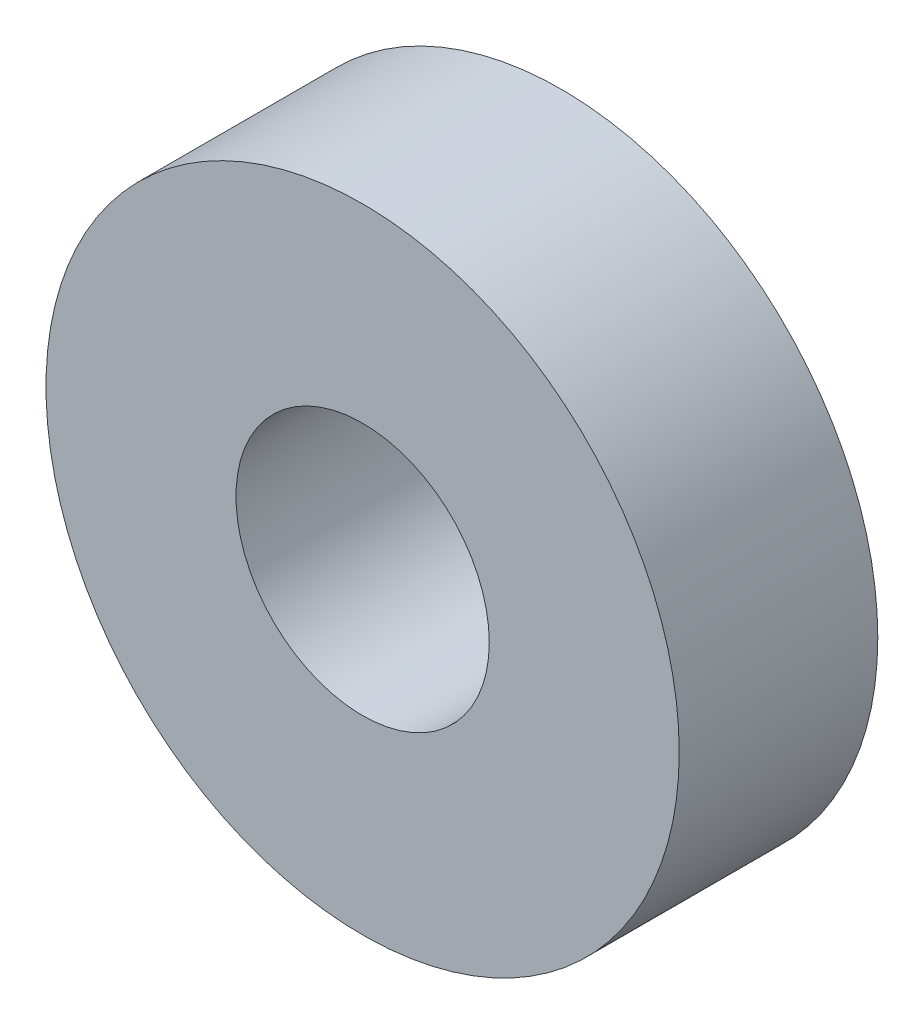
ISO-10303-21;
HEADER;
FILE_DESCRIPTION(('STEP AP214'),'2;1');
FILE_NAME('part.step','',(''),(''),'','','');
FILE_SCHEMA(('AUTOMOTIVE_DESIGN { 1 0 10303 214 1 1 1 1 }'));
ENDSEC;
DATA;
#1=APPLICATION_CONTEXT('core data for automotive mechanical design processes');
#2=APPLICATION_PROTOCOL_DEFINITION('international standard','automotive_design',2000,#1);
#3=PRODUCT_CONTEXT('',#1,'mechanical');
#4=PRODUCT('Part','Part','',(#3));
#5=PRODUCT_RELATED_PRODUCT_CATEGORY('part','',(#4));
#6=PRODUCT_DEFINITION_FORMATION('','',#4);
#7=PRODUCT_DEFINITION_CONTEXT('part definition',#1,'design');
#8=PRODUCT_DEFINITION('design','',#6,#7);
#9=PRODUCT_DEFINITION_SHAPE('','',#8);
#10=(LENGTH_UNIT() NAMED_UNIT(*) SI_UNIT(.MILLI.,.METRE.));
#11=(NAMED_UNIT(*) PLANE_ANGLE_UNIT() SI_UNIT($,.RADIAN.));
#12=(NAMED_UNIT(*) SI_UNIT($,.STERADIAN.) SOLID_ANGLE_UNIT());
#13=UNCERTAINTY_MEASURE_WITH_UNIT(LENGTH_MEASURE(1.E-05),#10,'distance_accuracy_value','');
#14=(GEOMETRIC_REPRESENTATION_CONTEXT(3) GLOBAL_UNCERTAINTY_ASSIGNED_CONTEXT((#13)) GLOBAL_UNIT_ASSIGNED_CONTEXT((#10,
#11,#12)) REPRESENTATION_CONTEXT('',''));
#15=CARTESIAN_POINT('',(0.,0.,0.));
#16=DIRECTION('',(0.,0.,1.));
#17=DIRECTION('',(1.,0.,0.));
#18=AXIS2_PLACEMENT_3D('',#15,#16,#17);
#19=CARTESIAN_POINT('',(0.,7.9375,-2.4892));
#20=DIRECTION('',(0.,0.,1.));
#21=DIRECTION('',(1.,0.,0.));
#22=AXIS2_PLACEMENT_3D('',#19,#20,#21);
#23=PLANE('',#22);
#24=CARTESIAN_POINT('',(0.,0.,-2.4892));
#25=DIRECTION('',(0.,0.,1.));
#26=DIRECTION('',(1.,0.,0.));
#27=AXIS2_PLACEMENT_3D('',#24,#25,#26);
#28=CIRCLE('',#27,3.175);
#29=CARTESIAN_POINT('',(3.175,0.,-2.4892));
#30=VERTEX_POINT('',#29);
#31=EDGE_CURVE('E18',#30,#30,#28,.T.);
#32=ORIENTED_EDGE('',*,*,#31,.T.);
#33=EDGE_LOOP('',(#32));
#34=FACE_BOUND('',#33,.T.);
#35=CARTESIAN_POINT('',(0.,0.,-2.4892));
#36=DIRECTION('',(0.,0.,1.));
#37=DIRECTION('',(1.,0.,0.));
#38=AXIS2_PLACEMENT_3D('',#35,#36,#37);
#39=CIRCLE('',#38,7.9375);
#40=CARTESIAN_POINT('',(7.9375,0.,-2.4892));
#41=VERTEX_POINT('',#40);
#42=EDGE_CURVE('E27',#41,#41,#39,.T.);
#43=ORIENTED_EDGE('',*,*,#42,.F.);
#44=EDGE_LOOP('',(#43));
#45=FACE_BOUND('',#44,.T.);
#46=ADVANCED_FACE('F15',(#34,#45),#23,.F.);
#47=CARTESIAN_POINT('',(0.,0.,26.5033284993587));
#48=DIRECTION('',(0.,0.,1.));
#49=DIRECTION('',(1.,0.,0.));
#50=AXIS2_PLACEMENT_3D('',#47,#48,#49);
#51=CYLINDRICAL_SURFACE('',#50,3.175);
#52=ORIENTED_EDGE('',*,*,#31,.F.);
#53=EDGE_LOOP('',(#52));
#54=FACE_BOUND('',#53,.T.);
#55=CARTESIAN_POINT('',(0.,0.,2.4892));
#56=DIRECTION('',(0.,0.,1.));
#57=DIRECTION('',(1.,0.,0.));
#58=AXIS2_PLACEMENT_3D('',#55,#56,#57);
#59=CIRCLE('',#58,3.175);
#60=CARTESIAN_POINT('',(3.175,0.,2.4892));
#61=VERTEX_POINT('',#60);
#62=EDGE_CURVE('E22',#61,#61,#59,.T.);
#63=ORIENTED_EDGE('',*,*,#62,.T.);
#64=EDGE_LOOP('',(#63));
#65=FACE_BOUND('',#64,.T.);
#66=ADVANCED_FACE('F37',(#54,#65),#51,.F.);
#67=CARTESIAN_POINT('',(0.,0.,26.5033284993587));
#68=DIRECTION('',(0.,0.,1.));
#69=DIRECTION('',(1.,0.,0.));
#70=AXIS2_PLACEMENT_3D('',#67,#68,#69);
#71=CYLINDRICAL_SURFACE('',#70,7.9375);
#72=CARTESIAN_POINT('',(0.,0.,2.4892));
#73=DIRECTION('',(0.,0.,1.));
#74=DIRECTION('',(1.,0.,0.));
#75=AXIS2_PLACEMENT_3D('',#72,#73,#74);
#76=CIRCLE('',#75,7.9375);
#77=CARTESIAN_POINT('',(7.9375,0.,2.4892));
#78=VERTEX_POINT('',#77);
#79=EDGE_CURVE('E10',#78,#78,#76,.F.);
#80=ORIENTED_EDGE('',*,*,#79,.T.);
#81=EDGE_LOOP('',(#80));
#82=FACE_BOUND('',#81,.T.);
#83=ORIENTED_EDGE('',*,*,#42,.T.);
#84=EDGE_LOOP('',(#83));
#85=FACE_BOUND('',#84,.T.);
#86=ADVANCED_FACE('F40',(#82,#85),#71,.T.);
#87=CARTESIAN_POINT('',(0.,7.9375,2.4892));
#88=DIRECTION('',(0.,0.,-1.));
#89=DIRECTION('',(-1.,0.,0.));
#90=AXIS2_PLACEMENT_3D('',#87,#88,#89);
#91=PLANE('',#90);
#92=ORIENTED_EDGE('',*,*,#79,.F.);
#93=EDGE_LOOP('',(#92));
#94=FACE_BOUND('',#93,.T.);
#95=ORIENTED_EDGE('',*,*,#62,.F.);
#96=EDGE_LOOP('',(#95));
#97=FACE_BOUND('',#96,.T.);
#98=ADVANCED_FACE('F43',(#94,#97),#91,.F.);
#99=CLOSED_SHELL('',(#46,#66,#86,#98));
#100=MANIFOLD_SOLID_BREP('B1',#99);
#101=ADVANCED_BREP_SHAPE_REPRESENTATION('',(#18,#100),#14);
#102=SHAPE_DEFINITION_REPRESENTATION(#9,#101);
ENDSEC;
END-ISO-10303-21;
